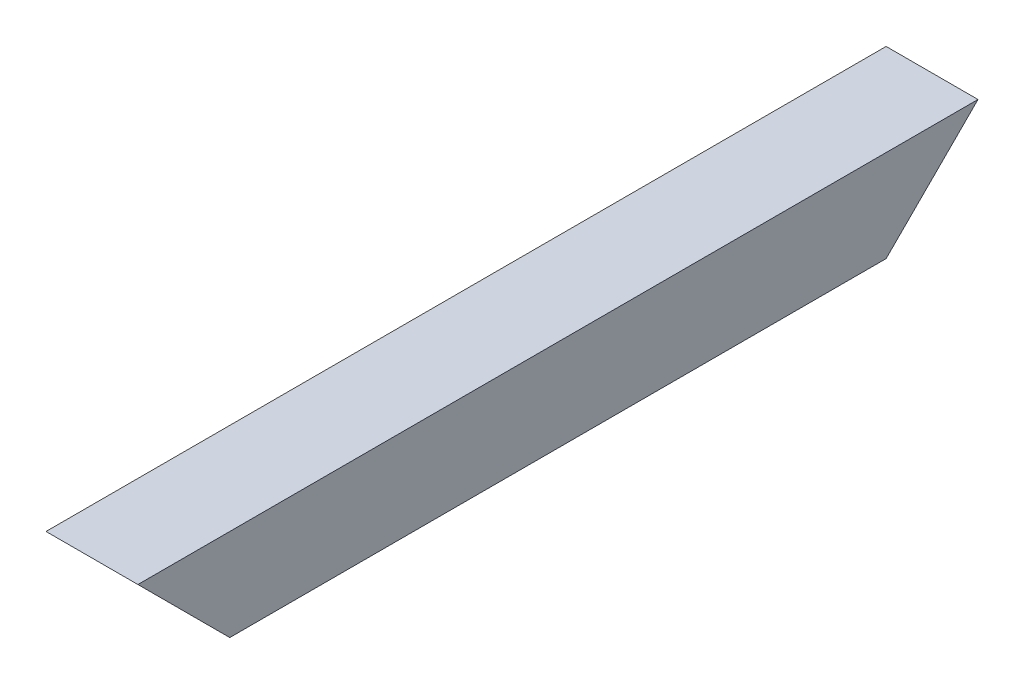
ISO-10303-21;
HEADER;
FILE_DESCRIPTION(('STEP AP214'),'2;1');
FILE_NAME('part.step','',(''),(''),'','','');
FILE_SCHEMA(('AUTOMOTIVE_DESIGN { 1 0 10303 214 1 1 1 1 }'));
ENDSEC;
DATA;
#1=APPLICATION_CONTEXT('core data for automotive mechanical design processes');
#2=APPLICATION_PROTOCOL_DEFINITION('international standard','automotive_design',2000,#1);
#3=PRODUCT_CONTEXT('',#1,'mechanical');
#4=PRODUCT('Part','Part','',(#3));
#5=PRODUCT_RELATED_PRODUCT_CATEGORY('part','',(#4));
#6=PRODUCT_DEFINITION_FORMATION('','',#4);
#7=PRODUCT_DEFINITION_CONTEXT('part definition',#1,'design');
#8=PRODUCT_DEFINITION('design','',#6,#7);
#9=PRODUCT_DEFINITION_SHAPE('','',#8);
#10=(LENGTH_UNIT() NAMED_UNIT(*) SI_UNIT(.MILLI.,.METRE.));
#11=(NAMED_UNIT(*) PLANE_ANGLE_UNIT() SI_UNIT($,.RADIAN.));
#12=(NAMED_UNIT(*) SI_UNIT($,.STERADIAN.) SOLID_ANGLE_UNIT());
#13=UNCERTAINTY_MEASURE_WITH_UNIT(LENGTH_MEASURE(1.E-05),#10,'distance_accuracy_value','');
#14=(GEOMETRIC_REPRESENTATION_CONTEXT(3) GLOBAL_UNCERTAINTY_ASSIGNED_CONTEXT((#13)) GLOBAL_UNIT_ASSIGNED_CONTEXT((#10,
#11,#12)) REPRESENTATION_CONTEXT('',''));
#15=CARTESIAN_POINT('',(0.,0.,0.));
#16=DIRECTION('',(0.,0.,1.));
#17=DIRECTION('',(1.,0.,0.));
#18=AXIS2_PLACEMENT_3D('',#15,#16,#17);
#19=CARTESIAN_POINT('',(0.,3.175,0.));
#20=DIRECTION('',(0.,-1.,0.));
#21=DIRECTION('',(0.,0.,-1.));
#22=AXIS2_PLACEMENT_3D('',#19,#20,#21);
#23=PLANE('',#22);
#24=DIRECTION('',(1.,0.,0.));
#25=VECTOR('',#24,1.);
#26=CARTESIAN_POINT('',(0.,3.17499999999999,3.17499999999999));
#27=LINE('',#26,#25);
#28=CARTESIAN_POINT('',(41.275,3.175,3.175));
#29=VERTEX_POINT('',#28);
#30=CARTESIAN_POINT('',(3.175,3.175,3.175));
#31=VERTEX_POINT('',#30);
#32=EDGE_CURVE('E98',#29,#31,#27,.F.);
#33=ORIENTED_EDGE('',*,*,#32,.F.);
#34=DIRECTION('',(0.,0.,-1.));
#35=VECTOR('',#34,1.);
#36=CARTESIAN_POINT('',(41.275,3.175,0.));
#37=LINE('',#36,#35);
#38=CARTESIAN_POINT('',(41.275,3.175,-320.675));
#39=VERTEX_POINT('',#38);
#40=EDGE_CURVE('E20',#29,#39,#37,.T.);
#41=ORIENTED_EDGE('',*,*,#40,.T.);
#42=DIRECTION('',(1.,0.,0.));
#43=VECTOR('',#42,1.);
#44=CARTESIAN_POINT('',(0.,3.17499999999999,-320.675));
#45=LINE('',#44,#43);
#46=CARTESIAN_POINT('',(3.175,3.17499999999999,-320.675));
#47=VERTEX_POINT('',#46);
#48=EDGE_CURVE('E125',#47,#39,#45,.T.);
#49=ORIENTED_EDGE('',*,*,#48,.F.);
#50=DIRECTION('',(0.,0.,-1.));
#51=VECTOR('',#50,1.);
#52=CARTESIAN_POINT('',(3.175,3.175,0.));
#53=LINE('',#52,#51);
#54=EDGE_CURVE('E107',#31,#47,#53,.T.);
#55=ORIENTED_EDGE('',*,*,#54,.F.);
#56=EDGE_LOOP('',(#33,#41,#49,#55));
#57=FACE_BOUND('',#56,.T.);
#58=ADVANCED_FACE('F17',(#57),#23,.F.);
#59=CARTESIAN_POINT('',(41.275,0.,0.));
#60=DIRECTION('',(1.,0.,0.));
#61=DIRECTION('',(0.,0.,-1.));
#62=AXIS2_PLACEMENT_3D('',#59,#60,#61);
#63=PLANE('',#62);
#64=DIRECTION('',(0.,-0.707106781186548,-0.707106781186548));
#65=VECTOR('',#64,1.);
#66=CARTESIAN_POINT('',(41.275,44.45,44.45));
#67=LINE('',#66,#65);
#68=CARTESIAN_POINT('',(41.275,41.275,41.275));
#69=VERTEX_POINT('',#68);
#70=EDGE_CURVE('E93',#69,#29,#67,.T.);
#71=ORIENTED_EDGE('',*,*,#70,.F.);
#72=DIRECTION('',(0.,0.,1.));
#73=VECTOR('',#72,1.);
#74=CARTESIAN_POINT('',(41.275,41.275,-361.95));
#75=LINE('',#74,#73);
#76=CARTESIAN_POINT('',(41.275,41.275,-358.775));
#77=VERTEX_POINT('',#76);
#78=EDGE_CURVE('E83',#69,#77,#75,.F.);
#79=ORIENTED_EDGE('',*,*,#78,.T.);
#80=DIRECTION('',(0.,0.707106781186548,-0.707106781186548));
#81=VECTOR('',#80,1.);
#82=CARTESIAN_POINT('',(41.275,0.,-317.5));
#83=LINE('',#82,#81);
#84=EDGE_CURVE('E123',#39,#77,#83,.T.);
#85=ORIENTED_EDGE('',*,*,#84,.F.);
#86=ORIENTED_EDGE('',*,*,#40,.F.);
#87=EDGE_LOOP('',(#71,#79,#85,#86));
#88=FACE_BOUND('',#87,.T.);
#89=ADVANCED_FACE('F94',(#88),#63,.F.);
#90=CARTESIAN_POINT('',(0.,41.275,-361.95));
#91=DIRECTION('',(0.,1.,0.));
#92=DIRECTION('',(0.,0.,1.));
#93=AXIS2_PLACEMENT_3D('',#90,#91,#92);
#94=PLANE('',#93);
#95=DIRECTION('',(1.,0.,0.));
#96=VECTOR('',#95,1.);
#97=CARTESIAN_POINT('',(0.,41.275,41.275));
#98=LINE('',#97,#96);
#99=CARTESIAN_POINT('',(3.175,41.275,41.275));
#100=VERTEX_POINT('',#99);
#101=EDGE_CURVE('E80',#100,#69,#98,.T.);
#102=ORIENTED_EDGE('',*,*,#101,.F.);
#103=DIRECTION('',(0.,0.,-1.));
#104=VECTOR('',#103,1.);
#105=CARTESIAN_POINT('',(3.175,41.275,0.));
#106=LINE('',#105,#104);
#107=CARTESIAN_POINT('',(3.175,41.275,-358.775));
#108=VERTEX_POINT('',#107);
#109=EDGE_CURVE('E91',#108,#100,#106,.F.);
#110=ORIENTED_EDGE('',*,*,#109,.F.);
#111=DIRECTION('',(1.,0.,0.));
#112=VECTOR('',#111,1.);
#113=CARTESIAN_POINT('',(0.,41.275,-358.775));
#114=LINE('',#113,#112);
#115=EDGE_CURVE('E87',#77,#108,#114,.F.);
#116=ORIENTED_EDGE('',*,*,#115,.F.);
#117=ORIENTED_EDGE('',*,*,#78,.F.);
#118=EDGE_LOOP('',(#102,#110,#116,#117));
#119=FACE_BOUND('',#118,.T.);
#120=ADVANCED_FACE('F85',(#119),#94,.F.);
#121=CARTESIAN_POINT('',(3.175,0.,0.));
#122=DIRECTION('',(1.,0.,0.));
#123=DIRECTION('',(0.,0.,-1.));
#124=AXIS2_PLACEMENT_3D('',#121,#122,#123);
#125=PLANE('',#124);
#126=ORIENTED_EDGE('',*,*,#54,.T.);
#127=DIRECTION('',(0.,0.707106781186548,-0.707106781186548));
#128=VECTOR('',#127,1.);
#129=CARTESIAN_POINT('',(3.175,0.,-317.5));
#130=LINE('',#129,#128);
#131=EDGE_CURVE('E117',#108,#47,#130,.F.);
#132=ORIENTED_EDGE('',*,*,#131,.F.);
#133=ORIENTED_EDGE('',*,*,#109,.T.);
#134=DIRECTION('',(0.,-0.707106781186548,-0.707106781186548));
#135=VECTOR('',#134,1.);
#136=CARTESIAN_POINT('',(3.175,44.45,44.45));
#137=LINE('',#136,#135);
#138=EDGE_CURVE('E104',#31,#100,#137,.F.);
#139=ORIENTED_EDGE('',*,*,#138,.F.);
#140=EDGE_LOOP('',(#126,#132,#133,#139));
#141=FACE_BOUND('',#140,.T.);
#142=ADVANCED_FACE('F115',(#141),#125,.T.);
#143=CARTESIAN_POINT('',(0.,0.,0.));
#144=DIRECTION('',(0.,-1.,0.));
#145=DIRECTION('',(0.,0.,-1.));
#146=AXIS2_PLACEMENT_3D('',#143,#144,#145);
#147=PLANE('',#146);
#148=DIRECTION('',(1.,0.,0.));
#149=VECTOR('',#148,1.);
#150=CARTESIAN_POINT('',(0.,0.,0.));
#151=LINE('',#150,#149);
#152=CARTESIAN_POINT('',(0.,0.,0.));
#153=VERTEX_POINT('',#152);
#154=CARTESIAN_POINT('',(44.45,0.,0.));
#155=VERTEX_POINT('',#154);
#156=EDGE_CURVE('E105',#153,#155,#151,.T.);
#157=ORIENTED_EDGE('',*,*,#156,.F.);
#158=DIRECTION('',(0.,0.,-1.));
#159=VECTOR('',#158,1.);
#160=CARTESIAN_POINT('',(0.,0.,0.));
#161=LINE('',#160,#159);
#162=CARTESIAN_POINT('',(0.,0.,-317.5));
#163=VERTEX_POINT('',#162);
#164=EDGE_CURVE('E120',#153,#163,#161,.T.);
#165=ORIENTED_EDGE('',*,*,#164,.T.);
#166=DIRECTION('',(1.,0.,0.));
#167=VECTOR('',#166,1.);
#168=CARTESIAN_POINT('',(0.,0.,-317.5));
#169=LINE('',#168,#167);
#170=CARTESIAN_POINT('',(44.45,0.,-317.5));
#171=VERTEX_POINT('',#170);
#172=EDGE_CURVE('E130',#171,#163,#169,.F.);
#173=ORIENTED_EDGE('',*,*,#172,.F.);
#174=DIRECTION('',(0.,0.,-1.));
#175=VECTOR('',#174,1.);
#176=CARTESIAN_POINT('',(44.45,0.,0.));
#177=LINE('',#176,#175);
#178=EDGE_CURVE('E135',#155,#171,#177,.T.);
#179=ORIENTED_EDGE('',*,*,#178,.F.);
#180=EDGE_LOOP('',(#157,#165,#173,#179));
#181=FACE_BOUND('',#180,.T.);
#182=ADVANCED_FACE('F166',(#181),#147,.T.);
#183=CARTESIAN_POINT('',(0.,44.45,44.45));
#184=DIRECTION('',(0.,-0.707106781186548,0.707106781186548));
#185=DIRECTION('',(0.,-0.707106781186548,-0.707106781186548));
#186=AXIS2_PLACEMENT_3D('',#183,#184,#185);
#187=PLANE('',#186);
#188=ORIENTED_EDGE('',*,*,#32,.T.);
#189=ORIENTED_EDGE('',*,*,#138,.T.);
#190=ORIENTED_EDGE('',*,*,#101,.T.);
#191=ORIENTED_EDGE('',*,*,#70,.T.);
#192=EDGE_LOOP('',(#188,#189,#190,#191));
#193=FACE_BOUND('',#192,.T.);
#194=DIRECTION('',(1.,0.,0.));
#195=VECTOR('',#194,1.);
#196=CARTESIAN_POINT('',(0.,44.45,44.45));
#197=LINE('',#196,#195);
#198=CARTESIAN_POINT('',(0.,44.45,44.45));
#199=VERTEX_POINT('',#198);
#200=CARTESIAN_POINT('',(44.45,44.45,44.45));
#201=VERTEX_POINT('',#200);
#202=EDGE_CURVE('E243',#199,#201,#197,.T.);
#203=ORIENTED_EDGE('',*,*,#202,.F.);
#204=DIRECTION('',(0.,-0.707106781186547,-0.707106781186547));
#205=VECTOR('',#204,1.);
#206=CARTESIAN_POINT('',(0.,44.45,44.45));
#207=LINE('',#206,#205);
#208=EDGE_CURVE('E241',#199,#153,#207,.T.);
#209=ORIENTED_EDGE('',*,*,#208,.T.);
#210=ORIENTED_EDGE('',*,*,#156,.T.);
#211=DIRECTION('',(0.,-0.707106781186547,-0.707106781186547));
#212=VECTOR('',#211,1.);
#213=CARTESIAN_POINT('',(44.45,44.45,44.45));
#214=LINE('',#213,#212);
#215=EDGE_CURVE('E137',#201,#155,#214,.T.);
#216=ORIENTED_EDGE('',*,*,#215,.F.);
#217=EDGE_LOOP('',(#203,#209,#210,#216));
#218=FACE_BOUND('',#217,.T.);
#219=ADVANCED_FACE('F101',(#193,#218),#187,.T.);
#220=CARTESIAN_POINT('',(44.45,0.,0.));
#221=DIRECTION('',(1.,0.,0.));
#222=DIRECTION('',(0.,0.,-1.));
#223=AXIS2_PLACEMENT_3D('',#220,#221,#222);
#224=PLANE('',#223);
#225=ORIENTED_EDGE('',*,*,#215,.T.);
#226=ORIENTED_EDGE('',*,*,#178,.T.);
#227=DIRECTION('',(0.,0.707106781186548,-0.707106781186548));
#228=VECTOR('',#227,1.);
#229=CARTESIAN_POINT('',(44.45,0.,-317.5));
#230=LINE('',#229,#228);
#231=CARTESIAN_POINT('',(44.45,44.45,-361.95));
#232=VERTEX_POINT('',#231);
#233=EDGE_CURVE('E132',#232,#171,#230,.F.);
#234=ORIENTED_EDGE('',*,*,#233,.F.);
#235=DIRECTION('',(0.,0.,1.));
#236=VECTOR('',#235,1.);
#237=CARTESIAN_POINT('',(44.45,44.45,-361.95));
#238=LINE('',#237,#236);
#239=EDGE_CURVE('E248',#201,#232,#238,.F.);
#240=ORIENTED_EDGE('',*,*,#239,.F.);
#241=EDGE_LOOP('',(#225,#226,#234,#240));
#242=FACE_BOUND('',#241,.T.);
#243=ADVANCED_FACE('F160',(#242),#224,.T.);
#244=CARTESIAN_POINT('',(0.,0.,-317.5));
#245=DIRECTION('',(0.,-0.707106781186548,-0.707106781186548));
#246=DIRECTION('',(0.,0.707106781186548,-0.707106781186548));
#247=AXIS2_PLACEMENT_3D('',#244,#245,#246);
#248=PLANE('',#247);
#249=ORIENTED_EDGE('',*,*,#115,.T.);
#250=ORIENTED_EDGE('',*,*,#131,.T.);
#251=ORIENTED_EDGE('',*,*,#48,.T.);
#252=ORIENTED_EDGE('',*,*,#84,.T.);
#253=EDGE_LOOP('',(#249,#250,#251,#252));
#254=FACE_BOUND('',#253,.T.);
#255=ORIENTED_EDGE('',*,*,#172,.T.);
#256=DIRECTION('',(0.,0.707106781186547,-0.707106781186547));
#257=VECTOR('',#256,1.);
#258=CARTESIAN_POINT('',(0.,0.,-317.5));
#259=LINE('',#258,#257);
#260=CARTESIAN_POINT('',(0.,44.45,-361.95));
#261=VERTEX_POINT('',#260);
#262=EDGE_CURVE('E35',#163,#261,#259,.T.);
#263=ORIENTED_EDGE('',*,*,#262,.T.);
#264=DIRECTION('',(1.,0.,0.));
#265=VECTOR('',#264,1.);
#266=CARTESIAN_POINT('',(0.,44.45,-361.95));
#267=LINE('',#266,#265);
#268=EDGE_CURVE('E26',#232,#261,#267,.F.);
#269=ORIENTED_EDGE('',*,*,#268,.F.);
#270=ORIENTED_EDGE('',*,*,#233,.T.);
#271=EDGE_LOOP('',(#255,#263,#269,#270));
#272=FACE_BOUND('',#271,.T.);
#273=ADVANCED_FACE('F122',(#254,#272),#248,.T.);
#274=CARTESIAN_POINT('',(0.,0.,0.));
#275=DIRECTION('',(1.,0.,0.));
#276=DIRECTION('',(0.,0.,-1.));
#277=AXIS2_PLACEMENT_3D('',#274,#275,#276);
#278=PLANE('',#277);
#279=DIRECTION('',(0.,0.,1.));
#280=VECTOR('',#279,1.);
#281=CARTESIAN_POINT('',(0.,44.45,-361.95));
#282=LINE('',#281,#280);
#283=EDGE_CURVE('E11',#261,#199,#282,.T.);
#284=ORIENTED_EDGE('',*,*,#283,.F.);
#285=ORIENTED_EDGE('',*,*,#262,.F.);
#286=ORIENTED_EDGE('',*,*,#164,.F.);
#287=ORIENTED_EDGE('',*,*,#208,.F.);
#288=EDGE_LOOP('',(#284,#285,#286,#287));
#289=FACE_BOUND('',#288,.T.);
#290=ADVANCED_FACE('F148',(#289),#278,.F.);
#291=CARTESIAN_POINT('',(0.,44.45,-361.95));
#292=DIRECTION('',(0.,1.,0.));
#293=DIRECTION('',(0.,0.,1.));
#294=AXIS2_PLACEMENT_3D('',#291,#292,#293);
#295=PLANE('',#294);
#296=ORIENTED_EDGE('',*,*,#268,.T.);
#297=ORIENTED_EDGE('',*,*,#283,.T.);
#298=ORIENTED_EDGE('',*,*,#202,.T.);
#299=ORIENTED_EDGE('',*,*,#239,.T.);
#300=EDGE_LOOP('',(#296,#297,#298,#299));
#301=FACE_BOUND('',#300,.T.);
#302=ADVANCED_FACE('F146',(#301),#295,.T.);
#303=CLOSED_SHELL('',(#58,#89,#120,#142,#182,#219,#243,#273,#290,#302));
#304=MANIFOLD_SOLID_BREP('B1',#303);
#305=ADVANCED_BREP_SHAPE_REPRESENTATION('',(#18,#304),#14);
#306=SHAPE_DEFINITION_REPRESENTATION(#9,#305);
ENDSEC;
END-ISO-10303-21;
